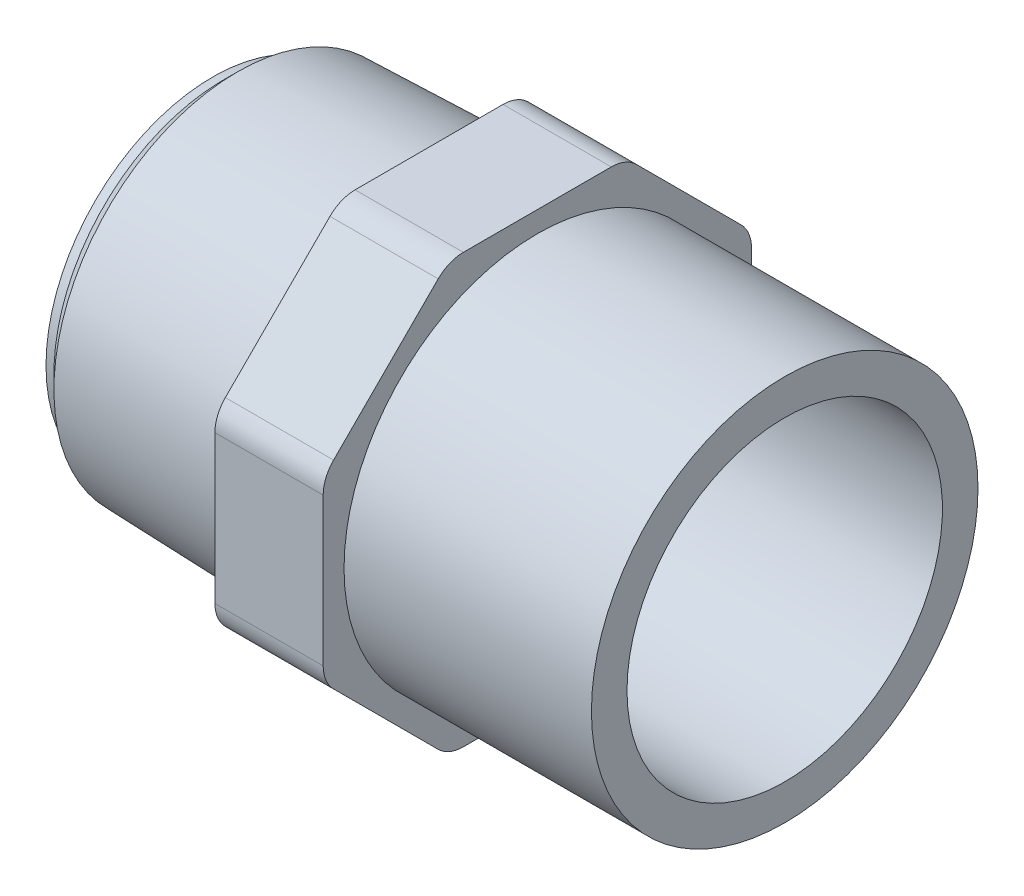
ISO-10303-21;
HEADER;
FILE_DESCRIPTION(('STEP AP214'),'2;1');
FILE_NAME('part.step','',(''),(''),'','','');
FILE_SCHEMA(('AUTOMOTIVE_DESIGN { 1 0 10303 214 1 1 1 1 }'));
ENDSEC;
DATA;
#1=APPLICATION_CONTEXT('core data for automotive mechanical design processes');
#2=APPLICATION_PROTOCOL_DEFINITION('international standard','automotive_design',2000,#1);
#3=PRODUCT_CONTEXT('',#1,'mechanical');
#4=PRODUCT('Part','Part','',(#3));
#5=PRODUCT_RELATED_PRODUCT_CATEGORY('part','',(#4));
#6=PRODUCT_DEFINITION_FORMATION('','',#4);
#7=PRODUCT_DEFINITION_CONTEXT('part definition',#1,'design');
#8=PRODUCT_DEFINITION('design','',#6,#7);
#9=PRODUCT_DEFINITION_SHAPE('','',#8);
#10=(LENGTH_UNIT() NAMED_UNIT(*) SI_UNIT(.MILLI.,.METRE.));
#11=(NAMED_UNIT(*) PLANE_ANGLE_UNIT() SI_UNIT($,.RADIAN.));
#12=(NAMED_UNIT(*) SI_UNIT($,.STERADIAN.) SOLID_ANGLE_UNIT());
#13=UNCERTAINTY_MEASURE_WITH_UNIT(LENGTH_MEASURE(1.E-05),#10,'distance_accuracy_value','');
#14=(GEOMETRIC_REPRESENTATION_CONTEXT(3) GLOBAL_UNCERTAINTY_ASSIGNED_CONTEXT((#13)) GLOBAL_UNIT_ASSIGNED_CONTEXT((#10,
#11,#12)) REPRESENTATION_CONTEXT('',''));
#15=CARTESIAN_POINT('',(0.,0.,0.));
#16=DIRECTION('',(0.,0.,1.));
#17=DIRECTION('',(1.,0.,0.));
#18=AXIS2_PLACEMENT_3D('',#15,#16,#17);
#19=CARTESIAN_POINT('',(-46.,-27.7,27.7));
#20=DIRECTION('',(-1.,0.,0.));
#21=DIRECTION('',(0.,1.,0.));
#22=AXIS2_PLACEMENT_3D('',#19,#20,#21);
#23=PLANE('',#22);
#24=CARTESIAN_POINT('',(-46.,0.,0.));
#25=DIRECTION('',(1.,0.,0.));
#26=DIRECTION('',(0.,0.,-1.));
#27=AXIS2_PLACEMENT_3D('',#24,#25,#26);
#28=CIRCLE('',#27,24.5235032844271);
#29=CARTESIAN_POINT('',(-46.,0.,-24.5235032844271));
#30=VERTEX_POINT('',#29);
#31=EDGE_CURVE('E18',#30,#30,#28,.F.);
#32=ORIENTED_EDGE('',*,*,#31,.F.);
#33=EDGE_LOOP('',(#32));
#34=FACE_BOUND('',#33,.T.);
#35=CARTESIAN_POINT('',(-46.,-23.1,9.56833329081846));
#36=DIRECTION('',(1.,0.,0.));
#37=DIRECTION('',(0.,0.,-1.));
#38=AXIS2_PLACEMENT_3D('',#35,#36,#37);
#39=CIRCLE('',#38,4.60000000000003);
#40=CARTESIAN_POINT('',(-46.,-26.3526911934581,12.8210244842766));
#41=VERTEX_POINT('',#40);
#42=CARTESIAN_POINT('',(-46.,-27.7,9.56833329081847));
#43=VERTEX_POINT('',#42);
#44=EDGE_CURVE('E235',#41,#43,#39,.T.);
#45=ORIENTED_EDGE('',*,*,#44,.F.);
#46=DIRECTION('',(0.,-0.707106781186547,-0.707106781186548));
#47=VECTOR('',#46,1.);
#48=CARTESIAN_POINT('',(-46.,-19.5868578388674,19.5868578388674));
#49=LINE('',#48,#47);
#50=CARTESIAN_POINT('',(-46.,-12.8210244842766,26.3526911934581));
#51=VERTEX_POINT('',#50);
#52=EDGE_CURVE('E132',#51,#41,#49,.T.);
#53=ORIENTED_EDGE('',*,*,#52,.F.);
#54=CARTESIAN_POINT('',(-46.,-9.56833329081848,23.1));
#55=DIRECTION('',(1.,0.,0.));
#56=DIRECTION('',(0.,0.,-1.));
#57=AXIS2_PLACEMENT_3D('',#54,#55,#56);
#58=CIRCLE('',#57,4.59999999999998);
#59=CARTESIAN_POINT('',(-46.,-9.56833329081848,27.7));
#60=VERTEX_POINT('',#59);
#61=EDGE_CURVE('E126',#60,#51,#58,.T.);
#62=ORIENTED_EDGE('',*,*,#61,.F.);
#63=DIRECTION('',(0.,-1.,0.));
#64=VECTOR('',#63,1.);
#65=CARTESIAN_POINT('',(-46.,0.,27.7));
#66=LINE('',#65,#64);
#67=CARTESIAN_POINT('',(-46.,9.5683332908185,27.7));
#68=VERTEX_POINT('',#67);
#69=EDGE_CURVE('E131',#68,#60,#66,.T.);
#70=ORIENTED_EDGE('',*,*,#69,.F.);
#71=CARTESIAN_POINT('',(-46.,9.5683332908185,23.1));
#72=DIRECTION('',(1.,0.,0.));
#73=DIRECTION('',(0.,0.,-1.));
#74=AXIS2_PLACEMENT_3D('',#71,#72,#73);
#75=CIRCLE('',#74,4.59999999999997);
#76=CARTESIAN_POINT('',(-46.,12.8210244842766,26.3526911934581));
#77=VERTEX_POINT('',#76);
#78=EDGE_CURVE('E147',#77,#68,#75,.T.);
#79=ORIENTED_EDGE('',*,*,#78,.F.);
#80=DIRECTION('',(0.,-0.707106781186548,0.707106781186547));
#81=VECTOR('',#80,1.);
#82=CARTESIAN_POINT('',(-46.,19.5868578388673,19.5868578388674));
#83=LINE('',#82,#81);
#84=CARTESIAN_POINT('',(-46.,26.3526911934581,12.8210244842766));
#85=VERTEX_POINT('',#84);
#86=EDGE_CURVE('E151',#85,#77,#83,.T.);
#87=ORIENTED_EDGE('',*,*,#86,.F.);
#88=CARTESIAN_POINT('',(-46.,23.1,9.56833329081849));
#89=DIRECTION('',(1.,0.,0.));
#90=DIRECTION('',(0.,0.,-1.));
#91=AXIS2_PLACEMENT_3D('',#88,#89,#90);
#92=CIRCLE('',#91,4.60000000000001);
#93=CARTESIAN_POINT('',(-46.,27.7,9.5683332908185));
#94=VERTEX_POINT('',#93);
#95=EDGE_CURVE('E225',#94,#85,#92,.T.);
#96=ORIENTED_EDGE('',*,*,#95,.F.);
#97=DIRECTION('',(0.,0.,1.));
#98=VECTOR('',#97,1.);
#99=CARTESIAN_POINT('',(-46.,27.7,0.));
#100=LINE('',#99,#98);
#101=CARTESIAN_POINT('',(-46.,27.7,-9.56833329081847));
#102=VERTEX_POINT('',#101);
#103=EDGE_CURVE('E155',#102,#94,#100,.T.);
#104=ORIENTED_EDGE('',*,*,#103,.F.);
#105=CARTESIAN_POINT('',(-46.,23.1,-9.56833329081846));
#106=DIRECTION('',(1.,0.,0.));
#107=DIRECTION('',(0.,0.,-1.));
#108=AXIS2_PLACEMENT_3D('',#105,#106,#107);
#109=CIRCLE('',#108,4.60000000000003);
#110=CARTESIAN_POINT('',(-46.,26.3526911934581,-12.8210244842766));
#111=VERTEX_POINT('',#110);
#112=EDGE_CURVE('E227',#111,#102,#109,.T.);
#113=ORIENTED_EDGE('',*,*,#112,.F.);
#114=DIRECTION('',(0.,0.707106781186547,0.707106781186548));
#115=VECTOR('',#114,1.);
#116=CARTESIAN_POINT('',(-46.,19.5868578388674,-19.5868578388674));
#117=LINE('',#116,#115);
#118=CARTESIAN_POINT('',(-46.,12.8210244842766,-26.3526911934581));
#119=VERTEX_POINT('',#118);
#120=EDGE_CURVE('E159',#119,#111,#117,.T.);
#121=ORIENTED_EDGE('',*,*,#120,.F.);
#122=CARTESIAN_POINT('',(-46.,9.56833329081852,-23.1));
#123=DIRECTION('',(1.,0.,0.));
#124=DIRECTION('',(0.,0.,-1.));
#125=AXIS2_PLACEMENT_3D('',#122,#123,#124);
#126=CIRCLE('',#125,4.59999999999995);
#127=CARTESIAN_POINT('',(-46.,9.56833329081851,-27.7));
#128=VERTEX_POINT('',#127);
#129=EDGE_CURVE('E229',#128,#119,#126,.T.);
#130=ORIENTED_EDGE('',*,*,#129,.F.);
#131=DIRECTION('',(0.,1.,0.));
#132=VECTOR('',#131,1.);
#133=CARTESIAN_POINT('',(-46.,0.,-27.7));
#134=LINE('',#133,#132);
#135=CARTESIAN_POINT('',(-46.,-9.56833329081848,-27.7));
#136=VERTEX_POINT('',#135);
#137=EDGE_CURVE('E163',#136,#128,#134,.T.);
#138=ORIENTED_EDGE('',*,*,#137,.F.);
#139=CARTESIAN_POINT('',(-46.,-9.56833329081847,-23.1));
#140=DIRECTION('',(1.,0.,0.));
#141=DIRECTION('',(0.,0.,-1.));
#142=AXIS2_PLACEMENT_3D('',#139,#140,#141);
#143=CIRCLE('',#142,4.60000000000002);
#144=CARTESIAN_POINT('',(-46.,-12.8210244842766,-26.3526911934581));
#145=VERTEX_POINT('',#144);
#146=EDGE_CURVE('E231',#145,#136,#143,.T.);
#147=ORIENTED_EDGE('',*,*,#146,.F.);
#148=DIRECTION('',(0.,0.707106781186548,-0.707106781186547));
#149=VECTOR('',#148,1.);
#150=CARTESIAN_POINT('',(-46.,-19.5868578388674,-19.5868578388674));
#151=LINE('',#150,#149);
#152=CARTESIAN_POINT('',(-46.,-26.3526911934581,-12.8210244842766));
#153=VERTEX_POINT('',#152);
#154=EDGE_CURVE('E167',#153,#145,#151,.T.);
#155=ORIENTED_EDGE('',*,*,#154,.F.);
#156=CARTESIAN_POINT('',(-46.,-23.1,-9.56833329081852));
#157=DIRECTION('',(1.,0.,0.));
#158=DIRECTION('',(0.,0.,-1.));
#159=AXIS2_PLACEMENT_3D('',#156,#157,#158);
#160=CIRCLE('',#159,4.59999999999997);
#161=CARTESIAN_POINT('',(-46.,-27.7,-9.56833329081851));
#162=VERTEX_POINT('',#161);
#163=EDGE_CURVE('E233',#162,#153,#160,.T.);
#164=ORIENTED_EDGE('',*,*,#163,.F.);
#165=DIRECTION('',(0.,0.,-1.));
#166=VECTOR('',#165,1.);
#167=CARTESIAN_POINT('',(-46.,-27.7,0.));
#168=LINE('',#167,#166);
#169=EDGE_CURVE('E171',#43,#162,#168,.T.);
#170=ORIENTED_EDGE('',*,*,#169,.F.);
#171=EDGE_LOOP('',(#45,#53,#62,#70,#79,#87,#96,#104,#113,#121,#130,#138,#147,#155,#164,#170));
#172=FACE_BOUND('',#171,.T.);
#173=ADVANCED_FACE('F15',(#34,#172),#23,.T.);
#174=CARTESIAN_POINT('',(-70.7730979570329,0.,0.));
#175=DIRECTION('',(1.,0.,0.));
#176=DIRECTION('',(0.,0.,-1.));
#177=AXIS2_PLACEMENT_3D('',#174,#175,#176);
#178=CONICAL_SURFACE('',#177,23.7519020429671,0.0311366738555787);
#179=CARTESIAN_POINT('',(-70.7730979570329,0.,0.));
#180=DIRECTION('',(-1.,0.,0.));
#181=DIRECTION('',(0.,1.,0.));
#182=AXIS2_PLACEMENT_3D('',#179,#180,#181);
#183=CIRCLE('',#182,23.7519020429671);
#184=CARTESIAN_POINT('',(-70.7730979570329,23.7519020429671,0.));
#185=VERTEX_POINT('',#184);
#186=EDGE_CURVE('E143',#185,#185,#183,.T.);
#187=ORIENTED_EDGE('',*,*,#186,.F.);
#188=EDGE_LOOP('',(#187));
#189=FACE_BOUND('',#188,.T.);
#190=ORIENTED_EDGE('',*,*,#31,.T.);
#191=EDGE_LOOP('',(#190));
#192=FACE_BOUND('',#191,.T.);
#193=ADVANCED_FACE('F537',(#189,#192),#178,.T.);
#194=CARTESIAN_POINT('',(-32.,-9.56833329081848,23.1));
#195=DIRECTION('',(1.,0.,0.));
#196=DIRECTION('',(0.,0.,-1.));
#197=AXIS2_PLACEMENT_3D('',#194,#195,#196);
#198=CYLINDRICAL_SURFACE('',#197,4.59999999999998);
#199=ORIENTED_EDGE('',*,*,#61,.T.);
#200=DIRECTION('',(1.,0.,0.));
#201=VECTOR('',#200,1.);
#202=CARTESIAN_POINT('',(-46.,-12.8210244842766,26.3526911934581));
#203=LINE('',#202,#201);
#204=CARTESIAN_POINT('',(-32.,-12.8210244842766,26.3526911934581));
#205=VERTEX_POINT('',#204);
#206=EDGE_CURVE('E135',#205,#51,#203,.F.);
#207=ORIENTED_EDGE('',*,*,#206,.F.);
#208=CARTESIAN_POINT('',(-32.,-9.56833329081848,23.1));
#209=DIRECTION('',(1.,0.,0.));
#210=DIRECTION('',(0.,0.,-1.));
#211=AXIS2_PLACEMENT_3D('',#208,#209,#210);
#212=CIRCLE('',#211,4.59999999999998);
#213=CARTESIAN_POINT('',(-32.,-9.56833329081848,27.7));
#214=VERTEX_POINT('',#213);
#215=EDGE_CURVE('E140',#214,#205,#212,.T.);
#216=ORIENTED_EDGE('',*,*,#215,.F.);
#217=DIRECTION('',(1.,0.,0.));
#218=VECTOR('',#217,1.);
#219=CARTESIAN_POINT('',(-46.,-9.56833329081848,27.7));
#220=LINE('',#219,#218);
#221=EDGE_CURVE('E137',#60,#214,#220,.T.);
#222=ORIENTED_EDGE('',*,*,#221,.F.);
#223=EDGE_LOOP('',(#199,#207,#216,#222));
#224=FACE_BOUND('',#223,.T.);
#225=ADVANCED_FACE('F138',(#224),#198,.T.);
#226=CARTESIAN_POINT('',(-46.,-12.8210244842766,26.3526911934581));
#227=DIRECTION('',(0.,-0.707106781186548,0.707106781186547));
#228=DIRECTION('',(0.,-0.707106781186547,-0.707106781186548));
#229=AXIS2_PLACEMENT_3D('',#226,#227,#228);
#230=PLANE('',#229);
#231=ORIENTED_EDGE('',*,*,#52,.T.);
#232=DIRECTION('',(-1.,0.,0.));
#233=VECTOR('',#232,1.);
#234=CARTESIAN_POINT('',(-39.,-26.3526911934581,12.8210244842766));
#235=LINE('',#234,#233);
#236=CARTESIAN_POINT('',(-32.,-26.3526911934581,12.8210244842766));
#237=VERTEX_POINT('',#236);
#238=EDGE_CURVE('E175',#237,#41,#235,.T.);
#239=ORIENTED_EDGE('',*,*,#238,.F.);
#240=CARTESIAN_POINT('',(-32.,-12.8210244842766,26.3526911934581));
#241=CARTESIAN_POINT('',(-32.,-13.3848439304925,25.7888717472422));
#242=CARTESIAN_POINT('',(-32.,-13.9486633767084,25.2250523010263));
#243=CARTESIAN_POINT('',(-32.,-15.0763022691402,24.0974134085945));
#244=CARTESIAN_POINT('',(-32.,-15.6401217153561,23.5335939623786));
#245=CARTESIAN_POINT('',(-32.,-16.7677606077879,22.4059550699468));
#246=CARTESIAN_POINT('',(-32.,-17.3315800540038,21.8421356237309));
#247=CARTESIAN_POINT('',(-32.,-18.4592189464356,20.7144967312991));
#248=CARTESIAN_POINT('',(-32.,-19.0230383926514,20.1506772850832));
#249=CARTESIAN_POINT('',(-32.,-20.1506772850832,19.0230383926515));
#250=CARTESIAN_POINT('',(-32.,-20.7144967312991,18.4592189464356));
#251=CARTESIAN_POINT('',(-32.,-21.8421356237309,17.3315800540038));
#252=CARTESIAN_POINT('',(-32.,-22.4059550699468,16.7677606077879));
#253=CARTESIAN_POINT('',(-32.,-23.5335939623786,15.6401217153561));
#254=CARTESIAN_POINT('',(-32.,-24.0974134085945,15.0763022691402));
#255=CARTESIAN_POINT('',(-32.,-25.2250523010263,13.9486633767084));
#256=CARTESIAN_POINT('',(-32.,-25.7888717472422,13.3848439304925));
#257=CARTESIAN_POINT('',(-32.,-26.3526911934581,12.8210244842766));
#258=B_SPLINE_CURVE_WITH_KNOTS('',3,(#240,#241,#242,#243,#244,#245,#246,#247,#248,#249,#250,
#251,#252,#253,#254,#255,#256,#257),.UNSPECIFIED.,.F.,.F.,(4,2,2,2,2,2,2,2,4),(0.,
2.39208332270463,4.78416664540926,7.17624996811388,9.56833329081851,11.9604166135231,
14.3524999362278,16.7445832589324,19.136666581637),.UNSPECIFIED.);
#259=EDGE_CURVE('E222',#205,#237,#258,.T.);
#260=ORIENTED_EDGE('',*,*,#259,.F.);
#261=ORIENTED_EDGE('',*,*,#206,.T.);
#262=EDGE_LOOP('',(#231,#239,#260,#261));
#263=FACE_BOUND('',#262,.T.);
#264=ADVANCED_FACE('F369',(#263),#230,.T.);
#265=CARTESIAN_POINT('',(-32.,-23.1,9.56833329081846));
#266=DIRECTION('',(1.,0.,0.));
#267=DIRECTION('',(0.,0.,-1.));
#268=AXIS2_PLACEMENT_3D('',#265,#266,#267);
#269=CYLINDRICAL_SURFACE('',#268,4.60000000000003);
#270=ORIENTED_EDGE('',*,*,#44,.T.);
#271=DIRECTION('',(1.,0.,0.));
#272=VECTOR('',#271,1.);
#273=CARTESIAN_POINT('',(-46.,-27.7,9.56833329081848));
#274=LINE('',#273,#272);
#275=CARTESIAN_POINT('',(-32.,-27.7,9.56833329081847));
#276=VERTEX_POINT('',#275);
#277=EDGE_CURVE('E174',#276,#43,#274,.F.);
#278=ORIENTED_EDGE('',*,*,#277,.F.);
#279=CARTESIAN_POINT('',(-32.,-23.1,9.56833329081846));
#280=DIRECTION('',(1.,0.,0.));
#281=DIRECTION('',(0.,0.,-1.));
#282=AXIS2_PLACEMENT_3D('',#279,#280,#281);
#283=CIRCLE('',#282,4.60000000000003);
#284=EDGE_CURVE('E219',#237,#276,#283,.T.);
#285=ORIENTED_EDGE('',*,*,#284,.F.);
#286=ORIENTED_EDGE('',*,*,#238,.T.);
#287=EDGE_LOOP('',(#270,#278,#285,#286));
#288=FACE_BOUND('',#287,.T.);
#289=ADVANCED_FACE('F370',(#288),#269,.T.);
#290=CARTESIAN_POINT('',(-46.,-27.7,9.56833329081848));
#291=DIRECTION('',(0.,-1.,0.));
#292=DIRECTION('',(0.,0.,-1.));
#293=AXIS2_PLACEMENT_3D('',#290,#291,#292);
#294=PLANE('',#293);
#295=ORIENTED_EDGE('',*,*,#169,.T.);
#296=DIRECTION('',(-1.,0.,0.));
#297=VECTOR('',#296,1.);
#298=CARTESIAN_POINT('',(-39.,-27.7,-9.5683332908185));
#299=LINE('',#298,#297);
#300=CARTESIAN_POINT('',(-32.,-27.7,-9.56833329081851));
#301=VERTEX_POINT('',#300);
#302=EDGE_CURVE('E173',#301,#162,#299,.T.);
#303=ORIENTED_EDGE('',*,*,#302,.F.);
#304=DIRECTION('',(0.,0.,-1.));
#305=VECTOR('',#304,1.);
#306=CARTESIAN_POINT('',(-32.,-27.7,27.7));
#307=LINE('',#306,#305);
#308=EDGE_CURVE('E218',#276,#301,#307,.T.);
#309=ORIENTED_EDGE('',*,*,#308,.F.);
#310=ORIENTED_EDGE('',*,*,#277,.T.);
#311=EDGE_LOOP('',(#295,#303,#309,#310));
#312=FACE_BOUND('',#311,.T.);
#313=ADVANCED_FACE('F326',(#312),#294,.T.);
#314=CARTESIAN_POINT('',(-32.,-23.1,-9.56833329081852));
#315=DIRECTION('',(1.,0.,0.));
#316=DIRECTION('',(0.,0.,-1.));
#317=AXIS2_PLACEMENT_3D('',#314,#315,#316);
#318=CYLINDRICAL_SURFACE('',#317,4.59999999999997);
#319=ORIENTED_EDGE('',*,*,#163,.T.);
#320=DIRECTION('',(1.,0.,0.));
#321=VECTOR('',#320,1.);
#322=CARTESIAN_POINT('',(-46.,-26.3526911934581,-12.8210244842766));
#323=LINE('',#322,#321);
#324=CARTESIAN_POINT('',(-32.,-26.3526911934581,-12.8210244842766));
#325=VERTEX_POINT('',#324);
#326=EDGE_CURVE('E170',#325,#153,#323,.F.);
#327=ORIENTED_EDGE('',*,*,#326,.F.);
#328=CARTESIAN_POINT('',(-32.,-23.1,-9.56833329081852));
#329=DIRECTION('',(1.,0.,0.));
#330=DIRECTION('',(0.,0.,-1.));
#331=AXIS2_PLACEMENT_3D('',#328,#329,#330);
#332=CIRCLE('',#331,4.59999999999997);
#333=EDGE_CURVE('E215',#301,#325,#332,.T.);
#334=ORIENTED_EDGE('',*,*,#333,.F.);
#335=ORIENTED_EDGE('',*,*,#302,.T.);
#336=EDGE_LOOP('',(#319,#327,#334,#335));
#337=FACE_BOUND('',#336,.T.);
#338=ADVANCED_FACE('F329',(#337),#318,.T.);
#339=CARTESIAN_POINT('',(-46.,-26.3526911934581,-12.8210244842766));
#340=DIRECTION('',(0.,-0.707106781186547,-0.707106781186548));
#341=DIRECTION('',(0.,0.707106781186548,-0.707106781186547));
#342=AXIS2_PLACEMENT_3D('',#339,#340,#341);
#343=PLANE('',#342);
#344=ORIENTED_EDGE('',*,*,#154,.T.);
#345=DIRECTION('',(-1.,0.,0.));
#346=VECTOR('',#345,1.);
#347=CARTESIAN_POINT('',(-39.,-12.8210244842766,-26.3526911934581));
#348=LINE('',#347,#346);
#349=CARTESIAN_POINT('',(-32.,-12.8210244842766,-26.3526911934581));
#350=VERTEX_POINT('',#349);
#351=EDGE_CURVE('E169',#350,#145,#348,.T.);
#352=ORIENTED_EDGE('',*,*,#351,.F.);
#353=CARTESIAN_POINT('',(-32.,-26.3526911934581,-12.8210244842766));
#354=CARTESIAN_POINT('',(-32.,-25.7888717472422,-13.3848439304925));
#355=CARTESIAN_POINT('',(-32.,-25.2250523010263,-13.9486633767084));
#356=CARTESIAN_POINT('',(-32.,-24.0974134085945,-15.0763022691402));
#357=CARTESIAN_POINT('',(-32.,-23.5335939623786,-15.6401217153561));
#358=CARTESIAN_POINT('',(-32.,-22.4059550699468,-16.7677606077879));
#359=CARTESIAN_POINT('',(-32.,-21.842135623731,-17.3315800540038));
#360=CARTESIAN_POINT('',(-32.,-20.7144967312992,-18.4592189464356));
#361=CARTESIAN_POINT('',(-32.,-20.1506772850833,-19.0230383926515));
#362=CARTESIAN_POINT('',(-32.,-19.0230383926515,-20.1506772850833));
#363=CARTESIAN_POINT('',(-32.,-18.4592189464356,-20.7144967312992));
#364=CARTESIAN_POINT('',(-32.,-17.3315800540038,-21.842135623731));
#365=CARTESIAN_POINT('',(-32.,-16.7677606077879,-22.4059550699469));
#366=CARTESIAN_POINT('',(-32.,-15.6401217153561,-23.5335939623786));
#367=CARTESIAN_POINT('',(-32.,-15.0763022691402,-24.0974134085945));
#368=CARTESIAN_POINT('',(-32.,-13.9486633767084,-25.2250523010263));
#369=CARTESIAN_POINT('',(-32.,-13.3848439304925,-25.7888717472422));
#370=CARTESIAN_POINT('',(-32.,-12.8210244842766,-26.3526911934581));
#371=B_SPLINE_CURVE_WITH_KNOTS('',3,(#353,#354,#355,#356,#357,#358,#359,#360,#361,#362,#363,
#364,#365,#366,#367,#368,#369,#370),.UNSPECIFIED.,.F.,.F.,(4,2,2,2,2,2,2,2,4),(0.,
2.39208332270462,4.78416664540924,7.17624996811387,9.5683332908185,11.9604166135231,
14.3524999362277,16.7445832589324,19.136666581637),.UNSPECIFIED.);
#372=EDGE_CURVE('E214',#325,#350,#371,.T.);
#373=ORIENTED_EDGE('',*,*,#372,.F.);
#374=ORIENTED_EDGE('',*,*,#326,.T.);
#375=EDGE_LOOP('',(#344,#352,#373,#374));
#376=FACE_BOUND('',#375,.T.);
#377=ADVANCED_FACE('F333',(#376),#343,.T.);
#378=CARTESIAN_POINT('',(-32.,-9.56833329081847,-23.1));
#379=DIRECTION('',(1.,0.,0.));
#380=DIRECTION('',(0.,0.,-1.));
#381=AXIS2_PLACEMENT_3D('',#378,#379,#380);
#382=CYLINDRICAL_SURFACE('',#381,4.60000000000002);
#383=ORIENTED_EDGE('',*,*,#146,.T.);
#384=DIRECTION('',(1.,0.,0.));
#385=VECTOR('',#384,1.);
#386=CARTESIAN_POINT('',(-46.,-9.56833329081849,-27.7));
#387=LINE('',#386,#385);
#388=CARTESIAN_POINT('',(-32.,-9.56833329081848,-27.7));
#389=VERTEX_POINT('',#388);
#390=EDGE_CURVE('E166',#389,#136,#387,.F.);
#391=ORIENTED_EDGE('',*,*,#390,.F.);
#392=CARTESIAN_POINT('',(-32.,-9.56833329081847,-23.1));
#393=DIRECTION('',(1.,0.,0.));
#394=DIRECTION('',(0.,0.,-1.));
#395=AXIS2_PLACEMENT_3D('',#392,#393,#394);
#396=CIRCLE('',#395,4.60000000000002);
#397=EDGE_CURVE('E211',#350,#389,#396,.T.);
#398=ORIENTED_EDGE('',*,*,#397,.F.);
#399=ORIENTED_EDGE('',*,*,#351,.T.);
#400=EDGE_LOOP('',(#383,#391,#398,#399));
#401=FACE_BOUND('',#400,.T.);
#402=ADVANCED_FACE('F337',(#401),#382,.T.);
#403=CARTESIAN_POINT('',(-46.,-9.56833329081849,-27.7));
#404=DIRECTION('',(0.,0.,-1.));
#405=DIRECTION('',(0.,1.,0.));
#406=AXIS2_PLACEMENT_3D('',#403,#404,#405);
#407=PLANE('',#406);
#408=ORIENTED_EDGE('',*,*,#137,.T.);
#409=DIRECTION('',(-1.,0.,0.));
#410=VECTOR('',#409,1.);
#411=CARTESIAN_POINT('',(-39.,9.5683332908185,-27.7));
#412=LINE('',#411,#410);
#413=CARTESIAN_POINT('',(-32.,9.56833329081851,-27.7));
#414=VERTEX_POINT('',#413);
#415=EDGE_CURVE('E165',#414,#128,#412,.T.);
#416=ORIENTED_EDGE('',*,*,#415,.F.);
#417=DIRECTION('',(0.,1.,0.));
#418=VECTOR('',#417,1.);
#419=CARTESIAN_POINT('',(-32.,0.,-27.7));
#420=LINE('',#419,#418);
#421=EDGE_CURVE('E210',#389,#414,#420,.T.);
#422=ORIENTED_EDGE('',*,*,#421,.F.);
#423=ORIENTED_EDGE('',*,*,#390,.T.);
#424=EDGE_LOOP('',(#408,#416,#422,#423));
#425=FACE_BOUND('',#424,.T.);
#426=ADVANCED_FACE('F341',(#425),#407,.T.);
#427=CARTESIAN_POINT('',(-32.,9.56833329081852,-23.1));
#428=DIRECTION('',(1.,0.,0.));
#429=DIRECTION('',(0.,0.,-1.));
#430=AXIS2_PLACEMENT_3D('',#427,#428,#429);
#431=CYLINDRICAL_SURFACE('',#430,4.59999999999995);
#432=ORIENTED_EDGE('',*,*,#129,.T.);
#433=DIRECTION('',(1.,0.,0.));
#434=VECTOR('',#433,1.);
#435=CARTESIAN_POINT('',(-46.,12.8210244842766,-26.3526911934581));
#436=LINE('',#435,#434);
#437=CARTESIAN_POINT('',(-32.,12.8210244842766,-26.3526911934581));
#438=VERTEX_POINT('',#437);
#439=EDGE_CURVE('E162',#438,#119,#436,.F.);
#440=ORIENTED_EDGE('',*,*,#439,.F.);
#441=CARTESIAN_POINT('',(-32.,9.56833329081852,-23.1));
#442=DIRECTION('',(1.,0.,0.));
#443=DIRECTION('',(0.,0.,-1.));
#444=AXIS2_PLACEMENT_3D('',#441,#442,#443);
#445=CIRCLE('',#444,4.59999999999995);
#446=EDGE_CURVE('E207',#414,#438,#445,.T.);
#447=ORIENTED_EDGE('',*,*,#446,.F.);
#448=ORIENTED_EDGE('',*,*,#415,.T.);
#449=EDGE_LOOP('',(#432,#440,#447,#448));
#450=FACE_BOUND('',#449,.T.);
#451=ADVANCED_FACE('F345',(#450),#431,.T.);
#452=CARTESIAN_POINT('',(-46.,12.8210244842766,-26.3526911934581));
#453=DIRECTION('',(0.,0.707106781186548,-0.707106781186547));
#454=DIRECTION('',(0.,0.707106781186547,0.707106781186548));
#455=AXIS2_PLACEMENT_3D('',#452,#453,#454);
#456=PLANE('',#455);
#457=ORIENTED_EDGE('',*,*,#120,.T.);
#458=DIRECTION('',(-1.,0.,0.));
#459=VECTOR('',#458,1.);
#460=CARTESIAN_POINT('',(-39.,26.3526911934581,-12.8210244842766));
#461=LINE('',#460,#459);
#462=CARTESIAN_POINT('',(-32.,26.3526911934581,-12.8210244842766));
#463=VERTEX_POINT('',#462);
#464=EDGE_CURVE('E161',#463,#111,#461,.T.);
#465=ORIENTED_EDGE('',*,*,#464,.F.);
#466=CARTESIAN_POINT('',(-32.,12.8210244842766,-26.3526911934581));
#467=CARTESIAN_POINT('',(-32.,13.3848439304925,-25.7888717472422));
#468=CARTESIAN_POINT('',(-32.,13.9486633767084,-25.2250523010263));
#469=CARTESIAN_POINT('',(-32.,15.0763022691402,-24.0974134085945));
#470=CARTESIAN_POINT('',(-32.,15.6401217153561,-23.5335939623786));
#471=CARTESIAN_POINT('',(-32.,16.7677606077879,-22.4059550699468));
#472=CARTESIAN_POINT('',(-32.,17.3315800540038,-21.8421356237309));
#473=CARTESIAN_POINT('',(-32.,18.4592189464356,-20.7144967312991));
#474=CARTESIAN_POINT('',(-32.,19.0230383926515,-20.1506772850833));
#475=CARTESIAN_POINT('',(-32.,20.1506772850833,-19.0230383926515));
#476=CARTESIAN_POINT('',(-32.,20.7144967312992,-18.4592189464356));
#477=CARTESIAN_POINT('',(-32.,21.8421356237309,-17.3315800540038));
#478=CARTESIAN_POINT('',(-32.,22.4059550699468,-16.7677606077879));
#479=CARTESIAN_POINT('',(-32.,23.5335939623786,-15.6401217153561));
#480=CARTESIAN_POINT('',(-32.,24.0974134085945,-15.0763022691402));
#481=CARTESIAN_POINT('',(-32.,25.2250523010263,-13.9486633767084));
#482=CARTESIAN_POINT('',(-32.,25.7888717472422,-13.3848439304925));
#483=CARTESIAN_POINT('',(-32.,26.3526911934581,-12.8210244842766));
#484=B_SPLINE_CURVE_WITH_KNOTS('',3,(#466,#467,#468,#469,#470,#471,#472,#473,#474,#475,#476,
#477,#478,#479,#480,#481,#482,#483),.UNSPECIFIED.,.F.,.F.,(4,2,2,2,2,2,2,2,4),(0.,
2.39208332270462,4.78416664540925,7.17624996811387,9.5683332908185,11.9604166135231,
14.3524999362277,16.7445832589324,19.136666581637),.UNSPECIFIED.);
#485=EDGE_CURVE('E206',#438,#463,#484,.T.);
#486=ORIENTED_EDGE('',*,*,#485,.F.);
#487=ORIENTED_EDGE('',*,*,#439,.T.);
#488=EDGE_LOOP('',(#457,#465,#486,#487));
#489=FACE_BOUND('',#488,.T.);
#490=ADVANCED_FACE('F349',(#489),#456,.T.);
#491=CARTESIAN_POINT('',(-32.,23.1,-9.56833329081846));
#492=DIRECTION('',(1.,0.,0.));
#493=DIRECTION('',(0.,0.,-1.));
#494=AXIS2_PLACEMENT_3D('',#491,#492,#493);
#495=CYLINDRICAL_SURFACE('',#494,4.60000000000003);
#496=ORIENTED_EDGE('',*,*,#112,.T.);
#497=DIRECTION('',(1.,0.,0.));
#498=VECTOR('',#497,1.);
#499=CARTESIAN_POINT('',(-46.,27.7,-9.56833329081848));
#500=LINE('',#499,#498);
#501=CARTESIAN_POINT('',(-32.,27.7,-9.56833329081847));
#502=VERTEX_POINT('',#501);
#503=EDGE_CURVE('E158',#502,#102,#500,.F.);
#504=ORIENTED_EDGE('',*,*,#503,.F.);
#505=CARTESIAN_POINT('',(-32.,23.1,-9.56833329081846));
#506=DIRECTION('',(1.,0.,0.));
#507=DIRECTION('',(0.,0.,-1.));
#508=AXIS2_PLACEMENT_3D('',#505,#506,#507);
#509=CIRCLE('',#508,4.60000000000003);
#510=EDGE_CURVE('E203',#463,#502,#509,.T.);
#511=ORIENTED_EDGE('',*,*,#510,.F.);
#512=ORIENTED_EDGE('',*,*,#464,.T.);
#513=EDGE_LOOP('',(#496,#504,#511,#512));
#514=FACE_BOUND('',#513,.T.);
#515=ADVANCED_FACE('F353',(#514),#495,.T.);
#516=CARTESIAN_POINT('',(-46.,27.7,-9.56833329081848));
#517=DIRECTION('',(0.,1.,0.));
#518=DIRECTION('',(0.,0.,1.));
#519=AXIS2_PLACEMENT_3D('',#516,#517,#518);
#520=PLANE('',#519);
#521=ORIENTED_EDGE('',*,*,#103,.T.);
#522=DIRECTION('',(-1.,0.,0.));
#523=VECTOR('',#522,1.);
#524=CARTESIAN_POINT('',(-39.,27.7,9.5683332908185));
#525=LINE('',#524,#523);
#526=CARTESIAN_POINT('',(-32.,27.7,9.56833329081849));
#527=VERTEX_POINT('',#526);
#528=EDGE_CURVE('E157',#527,#94,#525,.T.);
#529=ORIENTED_EDGE('',*,*,#528,.F.);
#530=DIRECTION('',(0.,0.,-1.));
#531=VECTOR('',#530,1.);
#532=CARTESIAN_POINT('',(-32.,27.7,27.7));
#533=LINE('',#532,#531);
#534=EDGE_CURVE('E202',#502,#527,#533,.F.);
#535=ORIENTED_EDGE('',*,*,#534,.F.);
#536=ORIENTED_EDGE('',*,*,#503,.T.);
#537=EDGE_LOOP('',(#521,#529,#535,#536));
#538=FACE_BOUND('',#537,.T.);
#539=ADVANCED_FACE('F357',(#538),#520,.T.);
#540=CARTESIAN_POINT('',(-32.,23.1,9.56833329081849));
#541=DIRECTION('',(1.,0.,0.));
#542=DIRECTION('',(0.,0.,-1.));
#543=AXIS2_PLACEMENT_3D('',#540,#541,#542);
#544=CYLINDRICAL_SURFACE('',#543,4.60000000000001);
#545=ORIENTED_EDGE('',*,*,#95,.T.);
#546=DIRECTION('',(1.,0.,0.));
#547=VECTOR('',#546,1.);
#548=CARTESIAN_POINT('',(-46.,26.3526911934581,12.8210244842766));
#549=LINE('',#548,#547);
#550=CARTESIAN_POINT('',(-32.,26.3526911934581,12.8210244842766));
#551=VERTEX_POINT('',#550);
#552=EDGE_CURVE('E154',#551,#85,#549,.F.);
#553=ORIENTED_EDGE('',*,*,#552,.F.);
#554=CARTESIAN_POINT('',(-32.,23.1,9.56833329081849));
#555=DIRECTION('',(1.,0.,0.));
#556=DIRECTION('',(0.,0.,-1.));
#557=AXIS2_PLACEMENT_3D('',#554,#555,#556);
#558=CIRCLE('',#557,4.60000000000001);
#559=EDGE_CURVE('E199',#527,#551,#558,.T.);
#560=ORIENTED_EDGE('',*,*,#559,.F.);
#561=ORIENTED_EDGE('',*,*,#528,.T.);
#562=EDGE_LOOP('',(#545,#553,#560,#561));
#563=FACE_BOUND('',#562,.T.);
#564=ADVANCED_FACE('F361',(#563),#544,.T.);
#565=CARTESIAN_POINT('',(-46.,26.3526911934581,12.8210244842766));
#566=DIRECTION('',(0.,0.707106781186547,0.707106781186548));
#567=DIRECTION('',(0.,-0.707106781186548,0.707106781186547));
#568=AXIS2_PLACEMENT_3D('',#565,#566,#567);
#569=PLANE('',#568);
#570=ORIENTED_EDGE('',*,*,#86,.T.);
#571=DIRECTION('',(-1.,0.,0.));
#572=VECTOR('',#571,1.);
#573=CARTESIAN_POINT('',(-39.,12.8210244842766,26.3526911934581));
#574=LINE('',#573,#572);
#575=CARTESIAN_POINT('',(-32.,12.8210244842766,26.3526911934581));
#576=VERTEX_POINT('',#575);
#577=EDGE_CURVE('E153',#576,#77,#574,.T.);
#578=ORIENTED_EDGE('',*,*,#577,.F.);
#579=CARTESIAN_POINT('',(-32.,26.3526911934581,12.8210244842766));
#580=CARTESIAN_POINT('',(-32.,25.7888717472422,13.3848439304925));
#581=CARTESIAN_POINT('',(-32.,25.2250523010263,13.9486633767084));
#582=CARTESIAN_POINT('',(-32.,24.0974134085945,15.0763022691402));
#583=CARTESIAN_POINT('',(-32.,23.5335939623786,15.6401217153561));
#584=CARTESIAN_POINT('',(-32.,22.4059550699468,16.7677606077879));
#585=CARTESIAN_POINT('',(-32.,21.8421356237309,17.3315800540038));
#586=CARTESIAN_POINT('',(-32.,20.7144967312991,18.4592189464356));
#587=CARTESIAN_POINT('',(-32.,20.1506772850833,19.0230383926515));
#588=CARTESIAN_POINT('',(-32.,19.0230383926515,20.1506772850833));
#589=CARTESIAN_POINT('',(-32.,18.4592189464356,20.7144967312992));
#590=CARTESIAN_POINT('',(-32.,17.3315800540038,21.842135623731));
#591=CARTESIAN_POINT('',(-32.,16.7677606077879,22.4059550699469));
#592=CARTESIAN_POINT('',(-32.,15.6401217153561,23.5335939623786));
#593=CARTESIAN_POINT('',(-32.,15.0763022691402,24.0974134085945));
#594=CARTESIAN_POINT('',(-32.,13.9486633767084,25.2250523010263));
#595=CARTESIAN_POINT('',(-32.,13.3848439304925,25.7888717472422));
#596=CARTESIAN_POINT('',(-32.,12.8210244842766,26.3526911934581));
#597=B_SPLINE_CURVE_WITH_KNOTS('',3,(#579,#580,#581,#582,#583,#584,#585,#586,#587,#588,#589,
#590,#591,#592,#593,#594,#595,#596),.UNSPECIFIED.,.F.,.F.,(4,2,2,2,2,2,2,2,4),(0.,
2.39208332270462,4.78416664540925,7.17624996811388,9.5683332908185,11.9604166135231,
14.3524999362278,16.7445832589324,19.136666581637),.UNSPECIFIED.);
#598=EDGE_CURVE('E198',#551,#576,#597,.T.);
#599=ORIENTED_EDGE('',*,*,#598,.F.);
#600=ORIENTED_EDGE('',*,*,#552,.T.);
#601=EDGE_LOOP('',(#570,#578,#599,#600));
#602=FACE_BOUND('',#601,.T.);
#603=ADVANCED_FACE('F365',(#602),#569,.T.);
#604=CARTESIAN_POINT('',(-32.,9.5683332908185,23.1));
#605=DIRECTION('',(1.,0.,0.));
#606=DIRECTION('',(0.,0.,-1.));
#607=AXIS2_PLACEMENT_3D('',#604,#605,#606);
#608=CYLINDRICAL_SURFACE('',#607,4.59999999999997);
#609=ORIENTED_EDGE('',*,*,#78,.T.);
#610=DIRECTION('',(1.,0.,0.));
#611=VECTOR('',#610,1.);
#612=CARTESIAN_POINT('',(-46.,9.56833329081849,27.7));
#613=LINE('',#612,#611);
#614=CARTESIAN_POINT('',(-32.,9.5683332908185,27.7));
#615=VERTEX_POINT('',#614);
#616=EDGE_CURVE('E33',#615,#68,#613,.F.);
#617=ORIENTED_EDGE('',*,*,#616,.F.);
#618=CARTESIAN_POINT('',(-32.,9.5683332908185,23.1));
#619=DIRECTION('',(1.,0.,0.));
#620=DIRECTION('',(0.,0.,-1.));
#621=AXIS2_PLACEMENT_3D('',#618,#619,#620);
#622=CIRCLE('',#621,4.59999999999997);
#623=EDGE_CURVE('E195',#576,#615,#622,.T.);
#624=ORIENTED_EDGE('',*,*,#623,.F.);
#625=ORIENTED_EDGE('',*,*,#577,.T.);
#626=EDGE_LOOP('',(#609,#617,#624,#625));
#627=FACE_BOUND('',#626,.T.);
#628=ADVANCED_FACE('F366',(#627),#608,.T.);
#629=CARTESIAN_POINT('',(-46.,9.56833329081849,27.7));
#630=DIRECTION('',(0.,0.,1.));
#631=DIRECTION('',(0.,-1.,0.));
#632=AXIS2_PLACEMENT_3D('',#629,#630,#631);
#633=PLANE('',#632);
#634=ORIENTED_EDGE('',*,*,#69,.T.);
#635=ORIENTED_EDGE('',*,*,#221,.T.);
#636=DIRECTION('',(0.,-1.,0.));
#637=VECTOR('',#636,1.);
#638=CARTESIAN_POINT('',(-32.,0.,27.7));
#639=LINE('',#638,#637);
#640=EDGE_CURVE('E194',#615,#214,#639,.T.);
#641=ORIENTED_EDGE('',*,*,#640,.F.);
#642=ORIENTED_EDGE('',*,*,#616,.T.);
#643=EDGE_LOOP('',(#634,#635,#641,#642));
#644=FACE_BOUND('',#643,.T.);
#645=ADVANCED_FACE('F145',(#644),#633,.T.);
#646=CARTESIAN_POINT('',(-72.6,0.,0.));
#647=DIRECTION('',(1.,0.,0.));
#648=DIRECTION('',(0.,0.,-1.));
#649=AXIS2_PLACEMENT_3D('',#646,#647,#648);
#650=CONICAL_SURFACE('',#649,21.925,0.785398163397444);
#651=CARTESIAN_POINT('',(-72.6,0.,0.));
#652=DIRECTION('',(1.,0.,0.));
#653=DIRECTION('',(0.,0.,-1.));
#654=AXIS2_PLACEMENT_3D('',#651,#652,#653);
#655=CIRCLE('',#654,21.925);
#656=CARTESIAN_POINT('',(-72.6,0.,-21.925));
#657=VERTEX_POINT('',#656);
#658=EDGE_CURVE('E191',#657,#657,#655,.F.);
#659=ORIENTED_EDGE('',*,*,#658,.F.);
#660=EDGE_LOOP('',(#659));
#661=FACE_BOUND('',#660,.T.);
#662=ORIENTED_EDGE('',*,*,#186,.T.);
#663=EDGE_LOOP('',(#662));
#664=FACE_BOUND('',#663,.T.);
#665=ADVANCED_FACE('F412',(#661,#664),#650,.T.);
#666=CARTESIAN_POINT('',(-32.,27.7,27.7));
#667=DIRECTION('',(1.,0.,0.));
#668=DIRECTION('',(0.,-1.,0.));
#669=AXIS2_PLACEMENT_3D('',#666,#667,#668);
#670=PLANE('',#669);
#671=CARTESIAN_POINT('',(-32.,0.,0.));
#672=DIRECTION('',(-1.,0.,0.));
#673=DIRECTION('',(0.,0.,1.));
#674=AXIS2_PLACEMENT_3D('',#671,#672,#673);
#675=CIRCLE('',#674,25.);
#676=CARTESIAN_POINT('',(-32.,0.,25.));
#677=VERTEX_POINT('',#676);
#678=EDGE_CURVE('E188',#677,#677,#675,.F.);
#679=ORIENTED_EDGE('',*,*,#678,.F.);
#680=EDGE_LOOP('',(#679));
#681=FACE_BOUND('',#680,.T.);
#682=ORIENTED_EDGE('',*,*,#623,.T.);
#683=ORIENTED_EDGE('',*,*,#640,.T.);
#684=ORIENTED_EDGE('',*,*,#215,.T.);
#685=ORIENTED_EDGE('',*,*,#259,.T.);
#686=ORIENTED_EDGE('',*,*,#284,.T.);
#687=ORIENTED_EDGE('',*,*,#308,.T.);
#688=ORIENTED_EDGE('',*,*,#333,.T.);
#689=ORIENTED_EDGE('',*,*,#372,.T.);
#690=ORIENTED_EDGE('',*,*,#397,.T.);
#691=ORIENTED_EDGE('',*,*,#421,.T.);
#692=ORIENTED_EDGE('',*,*,#446,.T.);
#693=ORIENTED_EDGE('',*,*,#485,.T.);
#694=ORIENTED_EDGE('',*,*,#510,.T.);
#695=ORIENTED_EDGE('',*,*,#534,.T.);
#696=ORIENTED_EDGE('',*,*,#559,.T.);
#697=ORIENTED_EDGE('',*,*,#598,.T.);
#698=EDGE_LOOP('',(#682,#683,#684,#685,#686,#687,#688,#689,#690,#691,#692,#693,#694,#695,#696,#697));
#699=FACE_BOUND('',#698,.T.);
#700=ADVANCED_FACE('F260',(#681,#699),#670,.T.);
#701=CARTESIAN_POINT('',(-72.6,-21.925,22.1881021083961));
#702=DIRECTION('',(-1.,0.,0.));
#703=DIRECTION('',(0.,1.,0.));
#704=AXIS2_PLACEMENT_3D('',#701,#702,#703);
#705=PLANE('',#704);
#706=CARTESIAN_POINT('',(-72.6,0.,0.));
#707=DIRECTION('',(-1.,0.,0.));
#708=DIRECTION('',(0.,0.,1.));
#709=AXIS2_PLACEMENT_3D('',#706,#707,#708);
#710=CIRCLE('',#709,21.55);
#711=CARTESIAN_POINT('',(-72.6,0.,21.55));
#712=VERTEX_POINT('',#711);
#713=EDGE_CURVE('E185',#712,#712,#710,.T.);
#714=ORIENTED_EDGE('',*,*,#713,.F.);
#715=EDGE_LOOP('',(#714));
#716=FACE_BOUND('',#715,.T.);
#717=ORIENTED_EDGE('',*,*,#658,.T.);
#718=EDGE_LOOP('',(#717));
#719=FACE_BOUND('',#718,.T.);
#720=ADVANCED_FACE('F258',(#716,#719),#705,.T.);
#721=CARTESIAN_POINT('',(-32.,0.,0.));
#722=DIRECTION('',(-1.,0.,0.));
#723=DIRECTION('',(0.,0.,1.));
#724=AXIS2_PLACEMENT_3D('',#721,#722,#723);
#725=CYLINDRICAL_SURFACE('',#724,25.);
#726=ORIENTED_EDGE('',*,*,#678,.T.);
#727=EDGE_LOOP('',(#726));
#728=FACE_BOUND('',#727,.T.);
#729=CARTESIAN_POINT('',(0.,0.,0.));
#730=DIRECTION('',(-1.,0.,0.));
#731=DIRECTION('',(0.,0.,1.));
#732=AXIS2_PLACEMENT_3D('',#729,#730,#731);
#733=CIRCLE('',#732,25.);
#734=CARTESIAN_POINT('',(0.,0.,25.));
#735=VERTEX_POINT('',#734);
#736=EDGE_CURVE('E182',#735,#735,#733,.F.);
#737=ORIENTED_EDGE('',*,*,#736,.F.);
#738=EDGE_LOOP('',(#737));
#739=FACE_BOUND('',#738,.T.);
#740=ADVANCED_FACE('F398',(#728,#739),#725,.T.);
#741=CARTESIAN_POINT('',(-74.,0.,0.));
#742=DIRECTION('',(-1.,0.,0.));
#743=DIRECTION('',(0.,0.,1.));
#744=AXIS2_PLACEMENT_3D('',#741,#742,#743);
#745=CYLINDRICAL_SURFACE('',#744,21.55);
#746=CARTESIAN_POINT('',(-74.,0.,0.));
#747=DIRECTION('',(-1.,0.,0.));
#748=DIRECTION('',(0.,0.,1.));
#749=AXIS2_PLACEMENT_3D('',#746,#747,#748);
#750=CIRCLE('',#749,21.55);
#751=CARTESIAN_POINT('',(-74.,0.,21.55));
#752=VERTEX_POINT('',#751);
#753=EDGE_CURVE('E179',#752,#752,#750,.T.);
#754=ORIENTED_EDGE('',*,*,#753,.F.);
#755=EDGE_LOOP('',(#754));
#756=FACE_BOUND('',#755,.T.);
#757=ORIENTED_EDGE('',*,*,#713,.T.);
#758=EDGE_LOOP('',(#757));
#759=FACE_BOUND('',#758,.T.);
#760=ADVANCED_FACE('F395',(#756,#759),#745,.T.);
#761=CARTESIAN_POINT('',(0.,25.,25.3000021082717));
#762=DIRECTION('',(1.,0.,0.));
#763=DIRECTION('',(0.,-1.,0.));
#764=AXIS2_PLACEMENT_3D('',#761,#762,#763);
#765=PLANE('',#764);
#766=CARTESIAN_POINT('',(0.,0.,0.));
#767=DIRECTION('',(-1.,0.,0.));
#768=DIRECTION('',(0.,0.,1.));
#769=AXIS2_PLACEMENT_3D('',#766,#767,#768);
#770=CIRCLE('',#769,20.4);
#771=CARTESIAN_POINT('',(0.,0.,20.4));
#772=VERTEX_POINT('',#771);
#773=EDGE_CURVE('E24',#772,#772,#770,.F.);
#774=ORIENTED_EDGE('',*,*,#773,.F.);
#775=EDGE_LOOP('',(#774));
#776=FACE_BOUND('',#775,.T.);
#777=ORIENTED_EDGE('',*,*,#736,.T.);
#778=EDGE_LOOP('',(#777));
#779=FACE_BOUND('',#778,.T.);
#780=ADVANCED_FACE('F388',(#776,#779),#765,.T.);
#781=CARTESIAN_POINT('',(-74.,-21.55,21.8086021082276));
#782=DIRECTION('',(-1.,0.,0.));
#783=DIRECTION('',(0.,1.,0.));
#784=AXIS2_PLACEMENT_3D('',#781,#782,#783);
#785=PLANE('',#784);
#786=CARTESIAN_POINT('',(-74.,0.,0.));
#787=DIRECTION('',(-1.,0.,0.));
#788=DIRECTION('',(0.,0.,1.));
#789=AXIS2_PLACEMENT_3D('',#786,#787,#788);
#790=CIRCLE('',#789,20.4);
#791=CARTESIAN_POINT('',(-74.,0.,20.4));
#792=VERTEX_POINT('',#791);
#793=EDGE_CURVE('E9',#792,#792,#790,.T.);
#794=ORIENTED_EDGE('',*,*,#793,.F.);
#795=EDGE_LOOP('',(#794));
#796=FACE_BOUND('',#795,.T.);
#797=ORIENTED_EDGE('',*,*,#753,.T.);
#798=EDGE_LOOP('',(#797));
#799=FACE_BOUND('',#798,.T.);
#800=ADVANCED_FACE('F382',(#796,#799),#785,.T.);
#801=CARTESIAN_POINT('',(0.,0.,0.));
#802=DIRECTION('',(-1.,0.,0.));
#803=DIRECTION('',(0.,0.,1.));
#804=AXIS2_PLACEMENT_3D('',#801,#802,#803);
#805=CYLINDRICAL_SURFACE('',#804,20.4);
#806=ORIENTED_EDGE('',*,*,#773,.T.);
#807=EDGE_LOOP('',(#806));
#808=FACE_BOUND('',#807,.T.);
#809=ORIENTED_EDGE('',*,*,#793,.T.);
#810=EDGE_LOOP('',(#809));
#811=FACE_BOUND('',#810,.T.);
#812=ADVANCED_FACE('F380',(#808,#811),#805,.F.);
#813=CLOSED_SHELL('',(#173,#193,#225,#264,#289,#313,#338,#377,#402,#426,#451,#490,#515,#539,
#564,#603,#628,#645,#665,#700,#720,#740,#760,#780,#800,#812));
#814=MANIFOLD_SOLID_BREP('B1',#813);
#815=ADVANCED_BREP_SHAPE_REPRESENTATION('',(#18,#814),#14);
#816=SHAPE_DEFINITION_REPRESENTATION(#9,#815);
ENDSEC;
END-ISO-10303-21;
